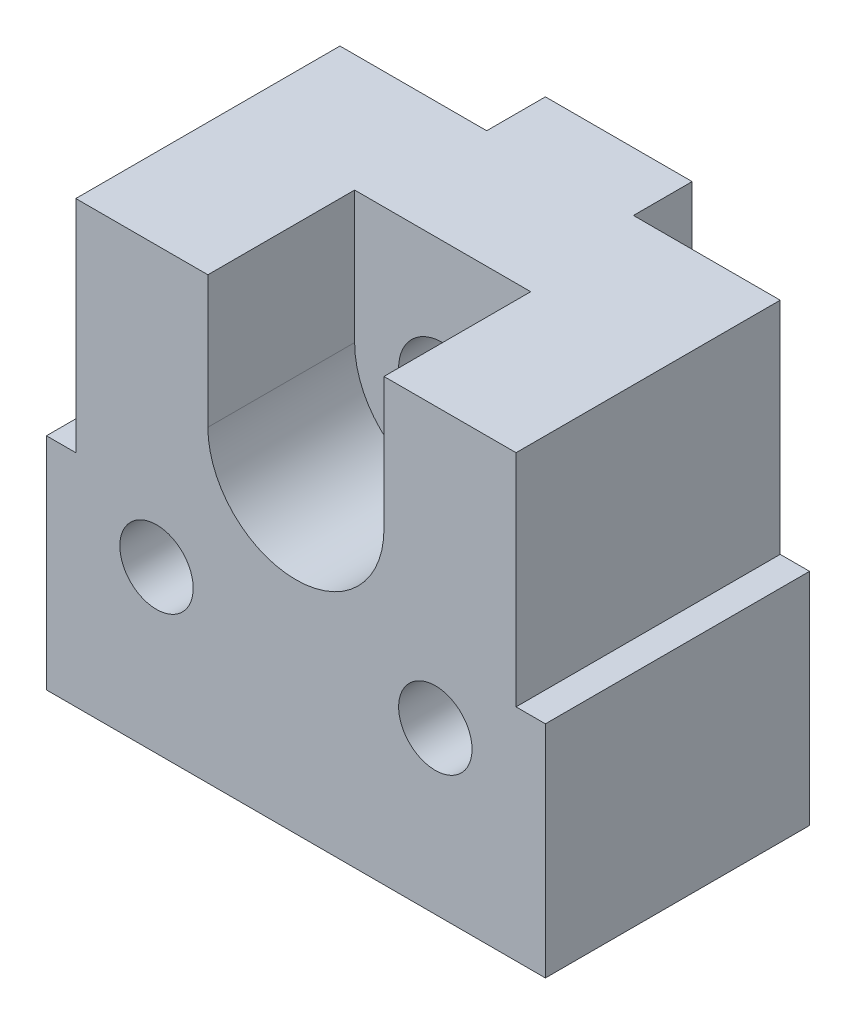
ISO-10303-21;
HEADER;
FILE_DESCRIPTION(('STEP AP214'),'2;1');
FILE_NAME('part.step','',(''),(''),'','','');
FILE_SCHEMA(('AUTOMOTIVE_DESIGN { 1 0 10303 214 1 1 1 1 }'));
ENDSEC;
DATA;
#1=APPLICATION_CONTEXT('core data for automotive mechanical design processes');
#2=APPLICATION_PROTOCOL_DEFINITION('international standard','automotive_design',2000,#1);
#3=PRODUCT_CONTEXT('',#1,'mechanical');
#4=PRODUCT('Part','Part','',(#3));
#5=PRODUCT_RELATED_PRODUCT_CATEGORY('part','',(#4));
#6=PRODUCT_DEFINITION_FORMATION('','',#4);
#7=PRODUCT_DEFINITION_CONTEXT('part definition',#1,'design');
#8=PRODUCT_DEFINITION('design','',#6,#7);
#9=PRODUCT_DEFINITION_SHAPE('','',#8);
#10=(LENGTH_UNIT() NAMED_UNIT(*) SI_UNIT(.MILLI.,.METRE.));
#11=(NAMED_UNIT(*) PLANE_ANGLE_UNIT() SI_UNIT($,.RADIAN.));
#12=(NAMED_UNIT(*) SI_UNIT($,.STERADIAN.) SOLID_ANGLE_UNIT());
#13=UNCERTAINTY_MEASURE_WITH_UNIT(LENGTH_MEASURE(1.E-05),#10,'distance_accuracy_value','');
#14=(GEOMETRIC_REPRESENTATION_CONTEXT(3) GLOBAL_UNCERTAINTY_ASSIGNED_CONTEXT((#13)) GLOBAL_UNIT_ASSIGNED_CONTEXT((#10,
#11,#12)) REPRESENTATION_CONTEXT('',''));
#15=CARTESIAN_POINT('',(0.,0.,0.));
#16=DIRECTION('',(0.,0.,1.));
#17=DIRECTION('',(1.,0.,0.));
#18=AXIS2_PLACEMENT_3D('',#15,#16,#17);
#19=CARTESIAN_POINT('',(0.,10.5,-9.));
#20=DIRECTION('',(0.,0.,1.));
#21=DIRECTION('',(1.,0.,0.));
#22=AXIS2_PLACEMENT_3D('',#19,#20,#21);
#23=CYLINDRICAL_SURFACE('',#22,1.5);
#24=CARTESIAN_POINT('',(0.,10.5,-5.));
#25=DIRECTION('',(0.,0.,1.));
#26=DIRECTION('',(1.,0.,0.));
#27=AXIS2_PLACEMENT_3D('',#24,#25,#26);
#28=CIRCLE('',#27,1.5);
#29=CARTESIAN_POINT('',(1.5,10.5,-5.));
#30=VERTEX_POINT('',#29);
#31=EDGE_CURVE('E20',#30,#30,#28,.F.);
#32=ORIENTED_EDGE('',*,*,#31,.F.);
#33=EDGE_LOOP('',(#32));
#34=FACE_BOUND('',#33,.T.);
#35=CARTESIAN_POINT('',(0.,10.5,-11.));
#36=DIRECTION('',(0.,0.,1.));
#37=DIRECTION('',(1.,0.,0.));
#38=AXIS2_PLACEMENT_3D('',#35,#36,#37);
#39=CIRCLE('',#38,1.5);
#40=CARTESIAN_POINT('',(1.5,10.5,-11.));
#41=VERTEX_POINT('',#40);
#42=EDGE_CURVE('E211',#41,#41,#39,.T.);
#43=ORIENTED_EDGE('',*,*,#42,.F.);
#44=EDGE_LOOP('',(#43));
#45=FACE_BOUND('',#44,.T.);
#46=ADVANCED_FACE('F17',(#34,#45),#23,.F.);
#47=CARTESIAN_POINT('',(0.,10.5,-5.));
#48=DIRECTION('',(0.,0.,1.));
#49=DIRECTION('',(1.,0.,0.));
#50=AXIS2_PLACEMENT_3D('',#47,#48,#49);
#51=PLANE('',#50);
#52=DIRECTION('',(0.,1.,0.));
#53=VECTOR('',#52,1.);
#54=CARTESIAN_POINT('',(-3.,15.,-5.));
#55=LINE('',#54,#53);
#56=CARTESIAN_POINT('',(-3.,10.5,-5.));
#57=VERTEX_POINT('',#56);
#58=CARTESIAN_POINT('',(-3.,15.,-5.));
#59=VERTEX_POINT('',#58);
#60=EDGE_CURVE('E127',#57,#59,#55,.T.);
#61=ORIENTED_EDGE('',*,*,#60,.F.);
#62=CARTESIAN_POINT('',(0.,10.5,-5.));
#63=DIRECTION('',(0.,0.,1.));
#64=DIRECTION('',(1.,0.,0.));
#65=AXIS2_PLACEMENT_3D('',#62,#63,#64);
#66=CIRCLE('',#65,3.);
#67=CARTESIAN_POINT('',(3.,10.5,-5.));
#68=VERTEX_POINT('',#67);
#69=EDGE_CURVE('E129',#57,#68,#66,.T.);
#70=ORIENTED_EDGE('',*,*,#69,.T.);
#71=DIRECTION('',(0.,1.,0.));
#72=VECTOR('',#71,1.);
#73=CARTESIAN_POINT('',(3.,10.5,-5.));
#74=LINE('',#73,#72);
#75=CARTESIAN_POINT('',(3.,15.,-5.));
#76=VERTEX_POINT('',#75);
#77=EDGE_CURVE('E133',#76,#68,#74,.F.);
#78=ORIENTED_EDGE('',*,*,#77,.F.);
#79=DIRECTION('',(1.,0.,0.));
#80=VECTOR('',#79,1.);
#81=CARTESIAN_POINT('',(7.5,15.,-5.));
#82=LINE('',#81,#80);
#83=EDGE_CURVE('E168',#59,#76,#82,.T.);
#84=ORIENTED_EDGE('',*,*,#83,.F.);
#85=EDGE_LOOP('',(#61,#70,#78,#84));
#86=FACE_BOUND('',#85,.T.);
#87=ORIENTED_EDGE('',*,*,#31,.T.);
#88=EDGE_LOOP('',(#87));
#89=FACE_BOUND('',#88,.T.);
#90=ADVANCED_FACE('F131',(#86,#89),#51,.T.);
#91=CARTESIAN_POINT('',(-7.5,7.50000000000001,-9.));
#92=DIRECTION('',(0.,1.,0.));
#93=DIRECTION('',(0.,0.,1.));
#94=AXIS2_PLACEMENT_3D('',#91,#92,#93);
#95=PLANE('',#94);
#96=DIRECTION('',(1.,0.,0.));
#97=VECTOR('',#96,1.);
#98=CARTESIAN_POINT('',(-7.5,7.50000000000001,0.));
#99=LINE('',#98,#97);
#100=CARTESIAN_POINT('',(-8.5,7.50000000000001,0.));
#101=VERTEX_POINT('',#100);
#102=CARTESIAN_POINT('',(-7.5,7.50000000000001,0.));
#103=VERTEX_POINT('',#102);
#104=EDGE_CURVE('E212',#101,#103,#99,.T.);
#105=ORIENTED_EDGE('',*,*,#104,.T.);
#106=DIRECTION('',(0.,0.,1.));
#107=VECTOR('',#106,1.);
#108=CARTESIAN_POINT('',(-7.5,7.50000000000001,-9.));
#109=LINE('',#108,#107);
#110=CARTESIAN_POINT('',(-7.5,7.50000000000001,-9.));
#111=VERTEX_POINT('',#110);
#112=EDGE_CURVE('E351',#111,#103,#109,.T.);
#113=ORIENTED_EDGE('',*,*,#112,.F.);
#114=DIRECTION('',(1.,0.,0.));
#115=VECTOR('',#114,1.);
#116=CARTESIAN_POINT('',(8.5,7.50000000000001,-9.));
#117=LINE('',#116,#115);
#118=CARTESIAN_POINT('',(-8.5,7.50000000000001,-9.));
#119=VERTEX_POINT('',#118);
#120=EDGE_CURVE('E183',#111,#119,#117,.F.);
#121=ORIENTED_EDGE('',*,*,#120,.T.);
#122=DIRECTION('',(0.,0.,1.));
#123=VECTOR('',#122,1.);
#124=CARTESIAN_POINT('',(-8.5,7.50000000000001,-9.));
#125=LINE('',#124,#123);
#126=EDGE_CURVE('E245',#101,#119,#125,.F.);
#127=ORIENTED_EDGE('',*,*,#126,.F.);
#128=EDGE_LOOP('',(#105,#113,#121,#127));
#129=FACE_BOUND('',#128,.T.);
#130=ADVANCED_FACE('F271',(#129),#95,.T.);
#131=CARTESIAN_POINT('',(-2.5,15.,-11.));
#132=DIRECTION('',(1.,0.,0.));
#133=DIRECTION('',(0.,1.,0.));
#134=AXIS2_PLACEMENT_3D('',#131,#132,#133);
#135=PLANE('',#134);
#136=DIRECTION('',(0.,1.,0.));
#137=VECTOR('',#136,1.);
#138=CARTESIAN_POINT('',(-2.5,0.,-11.));
#139=LINE('',#138,#137);
#140=CARTESIAN_POINT('',(-2.5,0.,-11.));
#141=VERTEX_POINT('',#140);
#142=CARTESIAN_POINT('',(-2.5,15.,-11.));
#143=VERTEX_POINT('',#142);
#144=EDGE_CURVE('E209',#141,#143,#139,.T.);
#145=ORIENTED_EDGE('',*,*,#144,.F.);
#146=DIRECTION('',(0.,0.,-1.));
#147=VECTOR('',#146,1.);
#148=CARTESIAN_POINT('',(-2.5,0.,-9.));
#149=LINE('',#148,#147);
#150=CARTESIAN_POINT('',(-2.5,0.,-9.));
#151=VERTEX_POINT('',#150);
#152=EDGE_CURVE('E384',#151,#141,#149,.T.);
#153=ORIENTED_EDGE('',*,*,#152,.F.);
#154=DIRECTION('',(0.,1.,0.));
#155=VECTOR('',#154,1.);
#156=CARTESIAN_POINT('',(-2.5,7.50000000000001,-9.));
#157=LINE('',#156,#155);
#158=CARTESIAN_POINT('',(-2.5,15.,-9.));
#159=VERTEX_POINT('',#158);
#160=EDGE_CURVE('E186',#151,#159,#157,.T.);
#161=ORIENTED_EDGE('',*,*,#160,.T.);
#162=DIRECTION('',(0.,0.,1.));
#163=VECTOR('',#162,1.);
#164=CARTESIAN_POINT('',(-2.5,15.,-9.));
#165=LINE('',#164,#163);
#166=EDGE_CURVE('E397',#143,#159,#165,.T.);
#167=ORIENTED_EDGE('',*,*,#166,.F.);
#168=EDGE_LOOP('',(#145,#153,#161,#167));
#169=FACE_BOUND('',#168,.T.);
#170=ADVANCED_FACE('F339',(#169),#135,.F.);
#171=CARTESIAN_POINT('',(2.5,0.,-11.));
#172=DIRECTION('',(0.,0.,-1.));
#173=DIRECTION('',(-1.,0.,0.));
#174=AXIS2_PLACEMENT_3D('',#171,#172,#173);
#175=PLANE('',#174);
#176=DIRECTION('',(0.,-1.,0.));
#177=VECTOR('',#176,1.);
#178=CARTESIAN_POINT('',(2.5,15.,-11.));
#179=LINE('',#178,#177);
#180=CARTESIAN_POINT('',(2.5,15.,-11.));
#181=VERTEX_POINT('',#180);
#182=CARTESIAN_POINT('',(2.5,0.,-11.));
#183=VERTEX_POINT('',#182);
#184=EDGE_CURVE('E189',#181,#183,#179,.T.);
#185=ORIENTED_EDGE('',*,*,#184,.T.);
#186=DIRECTION('',(1.,0.,0.));
#187=VECTOR('',#186,1.);
#188=CARTESIAN_POINT('',(8.5,0.,-11.));
#189=LINE('',#188,#187);
#190=EDGE_CURVE('E250',#141,#183,#189,.T.);
#191=ORIENTED_EDGE('',*,*,#190,.F.);
#192=ORIENTED_EDGE('',*,*,#144,.T.);
#193=DIRECTION('',(1.,0.,0.));
#194=VECTOR('',#193,1.);
#195=CARTESIAN_POINT('',(7.5,15.,-11.));
#196=LINE('',#195,#194);
#197=EDGE_CURVE('E219',#181,#143,#196,.F.);
#198=ORIENTED_EDGE('',*,*,#197,.F.);
#199=EDGE_LOOP('',(#185,#191,#192,#198));
#200=FACE_BOUND('',#199,.T.);
#201=ORIENTED_EDGE('',*,*,#42,.T.);
#202=EDGE_LOOP('',(#201));
#203=FACE_BOUND('',#202,.T.);
#204=ADVANCED_FACE('F263',(#200,#203),#175,.T.);
#205=CARTESIAN_POINT('',(2.5,15.,-11.));
#206=DIRECTION('',(-1.,0.,0.));
#207=DIRECTION('',(0.,-1.,0.));
#208=AXIS2_PLACEMENT_3D('',#205,#206,#207);
#209=PLANE('',#208);
#210=ORIENTED_EDGE('',*,*,#184,.F.);
#211=DIRECTION('',(0.,0.,1.));
#212=VECTOR('',#211,1.);
#213=CARTESIAN_POINT('',(2.5,15.,-9.));
#214=LINE('',#213,#212);
#215=CARTESIAN_POINT('',(2.5,15.,-9.));
#216=VERTEX_POINT('',#215);
#217=EDGE_CURVE('E192',#216,#181,#214,.F.);
#218=ORIENTED_EDGE('',*,*,#217,.F.);
#219=DIRECTION('',(0.,1.,0.));
#220=VECTOR('',#219,1.);
#221=CARTESIAN_POINT('',(2.5,7.50000000000001,-9.));
#222=LINE('',#221,#220);
#223=CARTESIAN_POINT('',(2.5,0.,-9.));
#224=VERTEX_POINT('',#223);
#225=EDGE_CURVE('E185',#216,#224,#222,.F.);
#226=ORIENTED_EDGE('',*,*,#225,.T.);
#227=DIRECTION('',(0.,0.,-1.));
#228=VECTOR('',#227,1.);
#229=CARTESIAN_POINT('',(2.5,0.,-9.));
#230=LINE('',#229,#228);
#231=EDGE_CURVE('E238',#183,#224,#230,.F.);
#232=ORIENTED_EDGE('',*,*,#231,.F.);
#233=EDGE_LOOP('',(#210,#218,#226,#232));
#234=FACE_BOUND('',#233,.T.);
#235=ADVANCED_FACE('F332',(#234),#209,.F.);
#236=CARTESIAN_POINT('',(8.5,7.50000000000001,-9.));
#237=DIRECTION('',(0.,1.,0.));
#238=DIRECTION('',(0.,0.,1.));
#239=AXIS2_PLACEMENT_3D('',#236,#237,#238);
#240=PLANE('',#239);
#241=DIRECTION('',(1.,0.,0.));
#242=VECTOR('',#241,1.);
#243=CARTESIAN_POINT('',(8.5,7.50000000000001,0.));
#244=LINE('',#243,#242);
#245=CARTESIAN_POINT('',(7.5,7.50000000000001,0.));
#246=VERTEX_POINT('',#245);
#247=CARTESIAN_POINT('',(8.5,7.50000000000001,0.));
#248=VERTEX_POINT('',#247);
#249=EDGE_CURVE('E35',#246,#248,#244,.T.);
#250=ORIENTED_EDGE('',*,*,#249,.T.);
#251=DIRECTION('',(0.,0.,-1.));
#252=VECTOR('',#251,1.);
#253=CARTESIAN_POINT('',(8.5,7.50000000000001,-9.));
#254=LINE('',#253,#252);
#255=CARTESIAN_POINT('',(8.5,7.50000000000001,-9.));
#256=VERTEX_POINT('',#255);
#257=EDGE_CURVE('E230',#256,#248,#254,.F.);
#258=ORIENTED_EDGE('',*,*,#257,.F.);
#259=DIRECTION('',(1.,0.,0.));
#260=VECTOR('',#259,1.);
#261=CARTESIAN_POINT('',(8.5,7.50000000000001,-9.));
#262=LINE('',#261,#260);
#263=CARTESIAN_POINT('',(7.5,7.5,-9.));
#264=VERTEX_POINT('',#263);
#265=EDGE_CURVE('E146',#256,#264,#262,.F.);
#266=ORIENTED_EDGE('',*,*,#265,.T.);
#267=DIRECTION('',(0.,0.,-1.));
#268=VECTOR('',#267,1.);
#269=CARTESIAN_POINT('',(7.5,7.50000000000001,-9.));
#270=LINE('',#269,#268);
#271=EDGE_CURVE('E174',#246,#264,#270,.T.);
#272=ORIENTED_EDGE('',*,*,#271,.F.);
#273=EDGE_LOOP('',(#250,#258,#266,#272));
#274=FACE_BOUND('',#273,.T.);
#275=ADVANCED_FACE('F328',(#274),#240,.T.);
#276=CARTESIAN_POINT('',(8.5,7.50000000000001,-9.));
#277=DIRECTION('',(0.,0.,1.));
#278=DIRECTION('',(1.,0.,0.));
#279=AXIS2_PLACEMENT_3D('',#276,#277,#278);
#280=PLANE('',#279);
#281=CARTESIAN_POINT('',(-4.75,5.50000000000001,-9.));
#282=DIRECTION('',(0.,0.,1.));
#283=DIRECTION('',(1.,0.,0.));
#284=AXIS2_PLACEMENT_3D('',#281,#282,#283);
#285=CIRCLE('',#284,1.25);
#286=CARTESIAN_POINT('',(-3.5,5.50000000000001,-9.));
#287=VERTEX_POINT('',#286);
#288=EDGE_CURVE('E205',#287,#287,#285,.T.);
#289=ORIENTED_EDGE('',*,*,#288,.T.);
#290=EDGE_LOOP('',(#289));
#291=FACE_BOUND('',#290,.T.);
#292=DIRECTION('',(0.,1.,0.));
#293=VECTOR('',#292,1.);
#294=CARTESIAN_POINT('',(-8.5,0.,-9.));
#295=LINE('',#294,#293);
#296=CARTESIAN_POINT('',(-8.5,0.,-9.));
#297=VERTEX_POINT('',#296);
#298=EDGE_CURVE('E393',#119,#297,#295,.F.);
#299=ORIENTED_EDGE('',*,*,#298,.F.);
#300=ORIENTED_EDGE('',*,*,#120,.F.);
#301=DIRECTION('',(0.,1.,0.));
#302=VECTOR('',#301,1.);
#303=CARTESIAN_POINT('',(-7.5,15.,-9.));
#304=LINE('',#303,#302);
#305=CARTESIAN_POINT('',(-7.5,15.,-9.));
#306=VERTEX_POINT('',#305);
#307=EDGE_CURVE('E361',#306,#111,#304,.F.);
#308=ORIENTED_EDGE('',*,*,#307,.F.);
#309=DIRECTION('',(1.,0.,0.));
#310=VECTOR('',#309,1.);
#311=CARTESIAN_POINT('',(7.5,15.,-9.));
#312=LINE('',#311,#310);
#313=EDGE_CURVE('E402',#159,#306,#312,.F.);
#314=ORIENTED_EDGE('',*,*,#313,.F.);
#315=ORIENTED_EDGE('',*,*,#160,.F.);
#316=DIRECTION('',(1.,0.,0.));
#317=VECTOR('',#316,1.);
#318=CARTESIAN_POINT('',(8.5,0.,-9.));
#319=LINE('',#318,#317);
#320=EDGE_CURVE('E387',#297,#151,#319,.T.);
#321=ORIENTED_EDGE('',*,*,#320,.F.);
#322=EDGE_LOOP('',(#299,#300,#308,#314,#315,#321));
#323=FACE_BOUND('',#322,.T.);
#324=ADVANCED_FACE('F324',(#291,#323),#280,.F.);
#325=CARTESIAN_POINT('',(8.5,7.50000000000001,-9.));
#326=DIRECTION('',(0.,0.,1.));
#327=DIRECTION('',(1.,0.,0.));
#328=AXIS2_PLACEMENT_3D('',#325,#326,#327);
#329=PLANE('',#328);
#330=CARTESIAN_POINT('',(4.75,5.50000000000001,-9.));
#331=DIRECTION('',(0.,0.,1.));
#332=DIRECTION('',(1.,0.,0.));
#333=AXIS2_PLACEMENT_3D('',#330,#331,#332);
#334=CIRCLE('',#333,1.25);
#335=CARTESIAN_POINT('',(6.,5.50000000000001,-9.));
#336=VERTEX_POINT('',#335);
#337=EDGE_CURVE('E163',#336,#336,#334,.T.);
#338=ORIENTED_EDGE('',*,*,#337,.T.);
#339=EDGE_LOOP('',(#338));
#340=FACE_BOUND('',#339,.T.);
#341=DIRECTION('',(0.,1.,0.));
#342=VECTOR('',#341,1.);
#343=CARTESIAN_POINT('',(7.5,15.,-9.));
#344=LINE('',#343,#342);
#345=CARTESIAN_POINT('',(7.5,15.,-9.));
#346=VERTEX_POINT('',#345);
#347=EDGE_CURVE('E175',#264,#346,#344,.T.);
#348=ORIENTED_EDGE('',*,*,#347,.F.);
#349=ORIENTED_EDGE('',*,*,#265,.F.);
#350=DIRECTION('',(0.,1.,0.));
#351=VECTOR('',#350,1.);
#352=CARTESIAN_POINT('',(8.5,0.,-9.));
#353=LINE('',#352,#351);
#354=CARTESIAN_POINT('',(8.5,0.,-9.));
#355=VERTEX_POINT('',#354);
#356=EDGE_CURVE('E233',#355,#256,#353,.T.);
#357=ORIENTED_EDGE('',*,*,#356,.F.);
#358=DIRECTION('',(1.,0.,0.));
#359=VECTOR('',#358,1.);
#360=CARTESIAN_POINT('',(8.5,0.,-9.));
#361=LINE('',#360,#359);
#362=EDGE_CURVE('E241',#224,#355,#361,.T.);
#363=ORIENTED_EDGE('',*,*,#362,.F.);
#364=ORIENTED_EDGE('',*,*,#225,.F.);
#365=DIRECTION('',(1.,0.,0.));
#366=VECTOR('',#365,1.);
#367=CARTESIAN_POINT('',(7.5,15.,-9.));
#368=LINE('',#367,#366);
#369=EDGE_CURVE('E167',#346,#216,#368,.F.);
#370=ORIENTED_EDGE('',*,*,#369,.F.);
#371=EDGE_LOOP('',(#348,#349,#357,#363,#364,#370));
#372=FACE_BOUND('',#371,.T.);
#373=ADVANCED_FACE('F321',(#340,#372),#329,.F.);
#374=CARTESIAN_POINT('',(3.,10.5,-5.));
#375=DIRECTION('',(-1.,0.,0.));
#376=DIRECTION('',(0.,0.,1.));
#377=AXIS2_PLACEMENT_3D('',#374,#375,#376);
#378=PLANE('',#377);
#379=DIRECTION('',(0.,1.,0.));
#380=VECTOR('',#379,1.);
#381=CARTESIAN_POINT('',(3.,7.50000000000001,0.));
#382=LINE('',#381,#380);
#383=CARTESIAN_POINT('',(3.,15.,0.));
#384=VERTEX_POINT('',#383);
#385=CARTESIAN_POINT('',(3.,10.5,0.));
#386=VERTEX_POINT('',#385);
#387=EDGE_CURVE('E162',#384,#386,#382,.F.);
#388=ORIENTED_EDGE('',*,*,#387,.F.);
#389=DIRECTION('',(0.,0.,1.));
#390=VECTOR('',#389,1.);
#391=CARTESIAN_POINT('',(3.,15.,-9.));
#392=LINE('',#391,#390);
#393=EDGE_CURVE('E144',#76,#384,#392,.T.);
#394=ORIENTED_EDGE('',*,*,#393,.F.);
#395=ORIENTED_EDGE('',*,*,#77,.T.);
#396=DIRECTION('',(0.,0.,1.));
#397=VECTOR('',#396,1.);
#398=CARTESIAN_POINT('',(3.,10.5,-5.));
#399=LINE('',#398,#397);
#400=EDGE_CURVE('E138',#68,#386,#399,.T.);
#401=ORIENTED_EDGE('',*,*,#400,.T.);
#402=EDGE_LOOP('',(#388,#394,#395,#401));
#403=FACE_BOUND('',#402,.T.);
#404=ADVANCED_FACE('F142',(#403),#378,.T.);
#405=CARTESIAN_POINT('',(0.,10.5,-5.));
#406=DIRECTION('',(0.,0.,1.));
#407=DIRECTION('',(1.,0.,0.));
#408=AXIS2_PLACEMENT_3D('',#405,#406,#407);
#409=CYLINDRICAL_SURFACE('',#408,3.);
#410=ORIENTED_EDGE('',*,*,#69,.F.);
#411=DIRECTION('',(0.,0.,1.));
#412=VECTOR('',#411,1.);
#413=CARTESIAN_POINT('',(-3.,10.5,-5.));
#414=LINE('',#413,#412);
#415=CARTESIAN_POINT('',(-3.,10.5,0.));
#416=VERTEX_POINT('',#415);
#417=EDGE_CURVE('E153',#416,#57,#414,.F.);
#418=ORIENTED_EDGE('',*,*,#417,.F.);
#419=CARTESIAN_POINT('',(0.,10.5,0.));
#420=DIRECTION('',(0.,0.,1.));
#421=DIRECTION('',(1.,0.,0.));
#422=AXIS2_PLACEMENT_3D('',#419,#420,#421);
#423=CIRCLE('',#422,3.);
#424=EDGE_CURVE('E150',#386,#416,#423,.F.);
#425=ORIENTED_EDGE('',*,*,#424,.F.);
#426=ORIENTED_EDGE('',*,*,#400,.F.);
#427=EDGE_LOOP('',(#410,#418,#425,#426));
#428=FACE_BOUND('',#427,.T.);
#429=ADVANCED_FACE('F148',(#428),#409,.F.);
#430=CARTESIAN_POINT('',(-3.,15.,-5.));
#431=DIRECTION('',(1.,0.,0.));
#432=DIRECTION('',(0.,1.,0.));
#433=AXIS2_PLACEMENT_3D('',#430,#431,#432);
#434=PLANE('',#433);
#435=DIRECTION('',(0.,1.,0.));
#436=VECTOR('',#435,1.);
#437=CARTESIAN_POINT('',(-3.,7.50000000000001,0.));
#438=LINE('',#437,#436);
#439=CARTESIAN_POINT('',(-3.,15.,0.));
#440=VERTEX_POINT('',#439);
#441=EDGE_CURVE('E256',#416,#440,#438,.T.);
#442=ORIENTED_EDGE('',*,*,#441,.F.);
#443=ORIENTED_EDGE('',*,*,#417,.T.);
#444=ORIENTED_EDGE('',*,*,#60,.T.);
#445=DIRECTION('',(0.,0.,1.));
#446=VECTOR('',#445,1.);
#447=CARTESIAN_POINT('',(-3.,15.,-9.));
#448=LINE('',#447,#446);
#449=EDGE_CURVE('E225',#440,#59,#448,.F.);
#450=ORIENTED_EDGE('',*,*,#449,.F.);
#451=EDGE_LOOP('',(#442,#443,#444,#450));
#452=FACE_BOUND('',#451,.T.);
#453=ADVANCED_FACE('F312',(#452),#434,.T.);
#454=CARTESIAN_POINT('',(7.5,15.,-9.));
#455=DIRECTION('',(0.,1.,0.));
#456=DIRECTION('',(0.,0.,1.));
#457=AXIS2_PLACEMENT_3D('',#454,#455,#456);
#458=PLANE('',#457);
#459=ORIENTED_EDGE('',*,*,#197,.T.);
#460=ORIENTED_EDGE('',*,*,#166,.T.);
#461=ORIENTED_EDGE('',*,*,#313,.T.);
#462=DIRECTION('',(0.,0.,1.));
#463=VECTOR('',#462,1.);
#464=CARTESIAN_POINT('',(-7.5,15.,-9.));
#465=LINE('',#464,#463);
#466=CARTESIAN_POINT('',(-7.5,15.,0.));
#467=VERTEX_POINT('',#466);
#468=EDGE_CURVE('E362',#467,#306,#465,.F.);
#469=ORIENTED_EDGE('',*,*,#468,.F.);
#470=DIRECTION('',(1.,0.,0.));
#471=VECTOR('',#470,1.);
#472=CARTESIAN_POINT('',(8.5,15.,0.));
#473=LINE('',#472,#471);
#474=EDGE_CURVE('E366',#440,#467,#473,.F.);
#475=ORIENTED_EDGE('',*,*,#474,.F.);
#476=ORIENTED_EDGE('',*,*,#449,.T.);
#477=ORIENTED_EDGE('',*,*,#83,.T.);
#478=ORIENTED_EDGE('',*,*,#393,.T.);
#479=DIRECTION('',(1.,0.,0.));
#480=VECTOR('',#479,1.);
#481=CARTESIAN_POINT('',(8.5,15.,0.));
#482=LINE('',#481,#480);
#483=CARTESIAN_POINT('',(7.5,15.,0.));
#484=VERTEX_POINT('',#483);
#485=EDGE_CURVE('E159',#484,#384,#482,.F.);
#486=ORIENTED_EDGE('',*,*,#485,.F.);
#487=DIRECTION('',(0.,0.,-1.));
#488=VECTOR('',#487,1.);
#489=CARTESIAN_POINT('',(7.5,15.,-9.));
#490=LINE('',#489,#488);
#491=EDGE_CURVE('E171',#346,#484,#490,.F.);
#492=ORIENTED_EDGE('',*,*,#491,.F.);
#493=ORIENTED_EDGE('',*,*,#369,.T.);
#494=ORIENTED_EDGE('',*,*,#217,.T.);
#495=EDGE_LOOP('',(#459,#460,#461,#469,#475,#476,#477,#478,#486,#492,#493,#494));
#496=FACE_BOUND('',#495,.T.);
#497=ADVANCED_FACE('F308',(#496),#458,.T.);
#498=CARTESIAN_POINT('',(-7.5,15.,-9.));
#499=DIRECTION('',(-1.,0.,0.));
#500=DIRECTION('',(0.,0.,1.));
#501=AXIS2_PLACEMENT_3D('',#498,#499,#500);
#502=PLANE('',#501);
#503=DIRECTION('',(0.,1.,0.));
#504=VECTOR('',#503,1.);
#505=CARTESIAN_POINT('',(-7.5,7.50000000000001,0.));
#506=LINE('',#505,#504);
#507=EDGE_CURVE('E359',#467,#103,#506,.F.);
#508=ORIENTED_EDGE('',*,*,#507,.F.);
#509=ORIENTED_EDGE('',*,*,#468,.T.);
#510=ORIENTED_EDGE('',*,*,#307,.T.);
#511=ORIENTED_EDGE('',*,*,#112,.T.);
#512=EDGE_LOOP('',(#508,#509,#510,#511));
#513=FACE_BOUND('',#512,.T.);
#514=ADVANCED_FACE('F304',(#513),#502,.T.);
#515=CARTESIAN_POINT('',(-8.5,0.,-9.));
#516=DIRECTION('',(-1.,0.,0.));
#517=DIRECTION('',(0.,0.,1.));
#518=AXIS2_PLACEMENT_3D('',#515,#516,#517);
#519=PLANE('',#518);
#520=DIRECTION('',(0.,1.,0.));
#521=VECTOR('',#520,1.);
#522=CARTESIAN_POINT('',(-8.5,7.50000000000001,0.));
#523=LINE('',#522,#521);
#524=CARTESIAN_POINT('',(-8.5,0.,0.));
#525=VERTEX_POINT('',#524);
#526=EDGE_CURVE('E367',#101,#525,#523,.F.);
#527=ORIENTED_EDGE('',*,*,#526,.F.);
#528=ORIENTED_EDGE('',*,*,#126,.T.);
#529=ORIENTED_EDGE('',*,*,#298,.T.);
#530=DIRECTION('',(0.,0.,-1.));
#531=VECTOR('',#530,1.);
#532=CARTESIAN_POINT('',(-8.5,0.,-9.));
#533=LINE('',#532,#531);
#534=EDGE_CURVE('E244',#525,#297,#533,.T.);
#535=ORIENTED_EDGE('',*,*,#534,.F.);
#536=EDGE_LOOP('',(#527,#528,#529,#535));
#537=FACE_BOUND('',#536,.T.);
#538=ADVANCED_FACE('F300',(#537),#519,.T.);
#539=CARTESIAN_POINT('',(8.5,0.,-9.));
#540=DIRECTION('',(0.,-1.,0.));
#541=DIRECTION('',(0.,0.,-1.));
#542=AXIS2_PLACEMENT_3D('',#539,#540,#541);
#543=PLANE('',#542);
#544=ORIENTED_EDGE('',*,*,#190,.T.);
#545=ORIENTED_EDGE('',*,*,#231,.T.);
#546=ORIENTED_EDGE('',*,*,#362,.T.);
#547=DIRECTION('',(0.,0.,-1.));
#548=VECTOR('',#547,1.);
#549=CARTESIAN_POINT('',(8.5,0.,-9.));
#550=LINE('',#549,#548);
#551=CARTESIAN_POINT('',(8.5,0.,0.));
#552=VERTEX_POINT('',#551);
#553=EDGE_CURVE('E197',#552,#355,#550,.T.);
#554=ORIENTED_EDGE('',*,*,#553,.F.);
#555=DIRECTION('',(1.,0.,0.));
#556=VECTOR('',#555,1.);
#557=CARTESIAN_POINT('',(8.5,0.,0.));
#558=LINE('',#557,#556);
#559=EDGE_CURVE('E369',#525,#552,#558,.T.);
#560=ORIENTED_EDGE('',*,*,#559,.F.);
#561=ORIENTED_EDGE('',*,*,#534,.T.);
#562=ORIENTED_EDGE('',*,*,#320,.T.);
#563=ORIENTED_EDGE('',*,*,#152,.T.);
#564=EDGE_LOOP('',(#544,#545,#546,#554,#560,#561,#562,#563));
#565=FACE_BOUND('',#564,.T.);
#566=ADVANCED_FACE('F296',(#565),#543,.T.);
#567=CARTESIAN_POINT('',(8.5,0.,-9.));
#568=DIRECTION('',(1.,0.,0.));
#569=DIRECTION('',(0.,0.,-1.));
#570=AXIS2_PLACEMENT_3D('',#567,#568,#569);
#571=PLANE('',#570);
#572=DIRECTION('',(0.,1.,0.));
#573=VECTOR('',#572,1.);
#574=CARTESIAN_POINT('',(8.5,7.50000000000001,0.));
#575=LINE('',#574,#573);
#576=EDGE_CURVE('E180',#552,#248,#575,.T.);
#577=ORIENTED_EDGE('',*,*,#576,.F.);
#578=ORIENTED_EDGE('',*,*,#553,.T.);
#579=ORIENTED_EDGE('',*,*,#356,.T.);
#580=ORIENTED_EDGE('',*,*,#257,.T.);
#581=EDGE_LOOP('',(#577,#578,#579,#580));
#582=FACE_BOUND('',#581,.T.);
#583=ADVANCED_FACE('F292',(#582),#571,.T.);
#584=CARTESIAN_POINT('',(7.5,15.,-9.));
#585=DIRECTION('',(1.,0.,0.));
#586=DIRECTION('',(0.,0.,-1.));
#587=AXIS2_PLACEMENT_3D('',#584,#585,#586);
#588=PLANE('',#587);
#589=DIRECTION('',(0.,1.,0.));
#590=VECTOR('',#589,1.);
#591=CARTESIAN_POINT('',(7.5,7.50000000000001,0.));
#592=LINE('',#591,#590);
#593=EDGE_CURVE('E178',#246,#484,#592,.T.);
#594=ORIENTED_EDGE('',*,*,#593,.F.);
#595=ORIENTED_EDGE('',*,*,#271,.T.);
#596=ORIENTED_EDGE('',*,*,#347,.T.);
#597=ORIENTED_EDGE('',*,*,#491,.T.);
#598=EDGE_LOOP('',(#594,#595,#596,#597));
#599=FACE_BOUND('',#598,.T.);
#600=ADVANCED_FACE('F288',(#599),#588,.T.);
#601=CARTESIAN_POINT('',(-4.75,5.50000000000001,-9.));
#602=DIRECTION('',(0.,0.,1.));
#603=DIRECTION('',(1.,0.,0.));
#604=AXIS2_PLACEMENT_3D('',#601,#602,#603);
#605=CYLINDRICAL_SURFACE('',#604,1.25);
#606=ORIENTED_EDGE('',*,*,#288,.F.);
#607=EDGE_LOOP('',(#606));
#608=FACE_BOUND('',#607,.T.);
#609=CARTESIAN_POINT('',(-4.75,5.50000000000001,0.));
#610=DIRECTION('',(0.,0.,1.));
#611=DIRECTION('',(1.,0.,0.));
#612=AXIS2_PLACEMENT_3D('',#609,#610,#611);
#613=CIRCLE('',#612,1.25);
#614=CARTESIAN_POINT('',(-3.5,5.50000000000001,0.));
#615=VERTEX_POINT('',#614);
#616=EDGE_CURVE('E26',#615,#615,#613,.F.);
#617=ORIENTED_EDGE('',*,*,#616,.F.);
#618=EDGE_LOOP('',(#617));
#619=FACE_BOUND('',#618,.T.);
#620=ADVANCED_FACE('F281',(#608,#619),#605,.F.);
#621=CARTESIAN_POINT('',(4.75,5.50000000000001,-9.));
#622=DIRECTION('',(0.,0.,1.));
#623=DIRECTION('',(1.,0.,0.));
#624=AXIS2_PLACEMENT_3D('',#621,#622,#623);
#625=CYLINDRICAL_SURFACE('',#624,1.25);
#626=ORIENTED_EDGE('',*,*,#337,.F.);
#627=EDGE_LOOP('',(#626));
#628=FACE_BOUND('',#627,.T.);
#629=CARTESIAN_POINT('',(4.75,5.50000000000001,0.));
#630=DIRECTION('',(0.,0.,1.));
#631=DIRECTION('',(1.,0.,0.));
#632=AXIS2_PLACEMENT_3D('',#629,#630,#631);
#633=CIRCLE('',#632,1.25);
#634=CARTESIAN_POINT('',(6.,5.50000000000001,0.));
#635=VERTEX_POINT('',#634);
#636=EDGE_CURVE('E11',#635,#635,#633,.F.);
#637=ORIENTED_EDGE('',*,*,#636,.F.);
#638=EDGE_LOOP('',(#637));
#639=FACE_BOUND('',#638,.T.);
#640=ADVANCED_FACE('F275',(#628,#639),#625,.F.);
#641=CARTESIAN_POINT('',(8.5,7.50000000000001,0.));
#642=DIRECTION('',(0.,0.,1.));
#643=DIRECTION('',(1.,0.,0.));
#644=AXIS2_PLACEMENT_3D('',#641,#642,#643);
#645=PLANE('',#644);
#646=ORIENTED_EDGE('',*,*,#636,.T.);
#647=EDGE_LOOP('',(#646));
#648=FACE_BOUND('',#647,.T.);
#649=ORIENTED_EDGE('',*,*,#616,.T.);
#650=EDGE_LOOP('',(#649));
#651=FACE_BOUND('',#650,.T.);
#652=ORIENTED_EDGE('',*,*,#249,.F.);
#653=ORIENTED_EDGE('',*,*,#593,.T.);
#654=ORIENTED_EDGE('',*,*,#485,.T.);
#655=ORIENTED_EDGE('',*,*,#387,.T.);
#656=ORIENTED_EDGE('',*,*,#424,.T.);
#657=ORIENTED_EDGE('',*,*,#441,.T.);
#658=ORIENTED_EDGE('',*,*,#474,.T.);
#659=ORIENTED_EDGE('',*,*,#507,.T.);
#660=ORIENTED_EDGE('',*,*,#104,.F.);
#661=ORIENTED_EDGE('',*,*,#526,.T.);
#662=ORIENTED_EDGE('',*,*,#559,.T.);
#663=ORIENTED_EDGE('',*,*,#576,.T.);
#664=EDGE_LOOP('',(#652,#653,#654,#655,#656,#657,#658,#659,#660,#661,#662,#663));
#665=FACE_BOUND('',#664,.T.);
#666=ADVANCED_FACE('F273',(#648,#651,#665),#645,.T.);
#667=CLOSED_SHELL('',(#46,#90,#130,#170,#204,#235,#275,#324,#373,#404,#429,#453,#497,#514,#538,
#566,#583,#600,#620,#640,#666));
#668=MANIFOLD_SOLID_BREP('B1',#667);
#669=ADVANCED_BREP_SHAPE_REPRESENTATION('',(#18,#668),#14);
#670=SHAPE_DEFINITION_REPRESENTATION(#9,#669);
ENDSEC;
END-ISO-10303-21;
